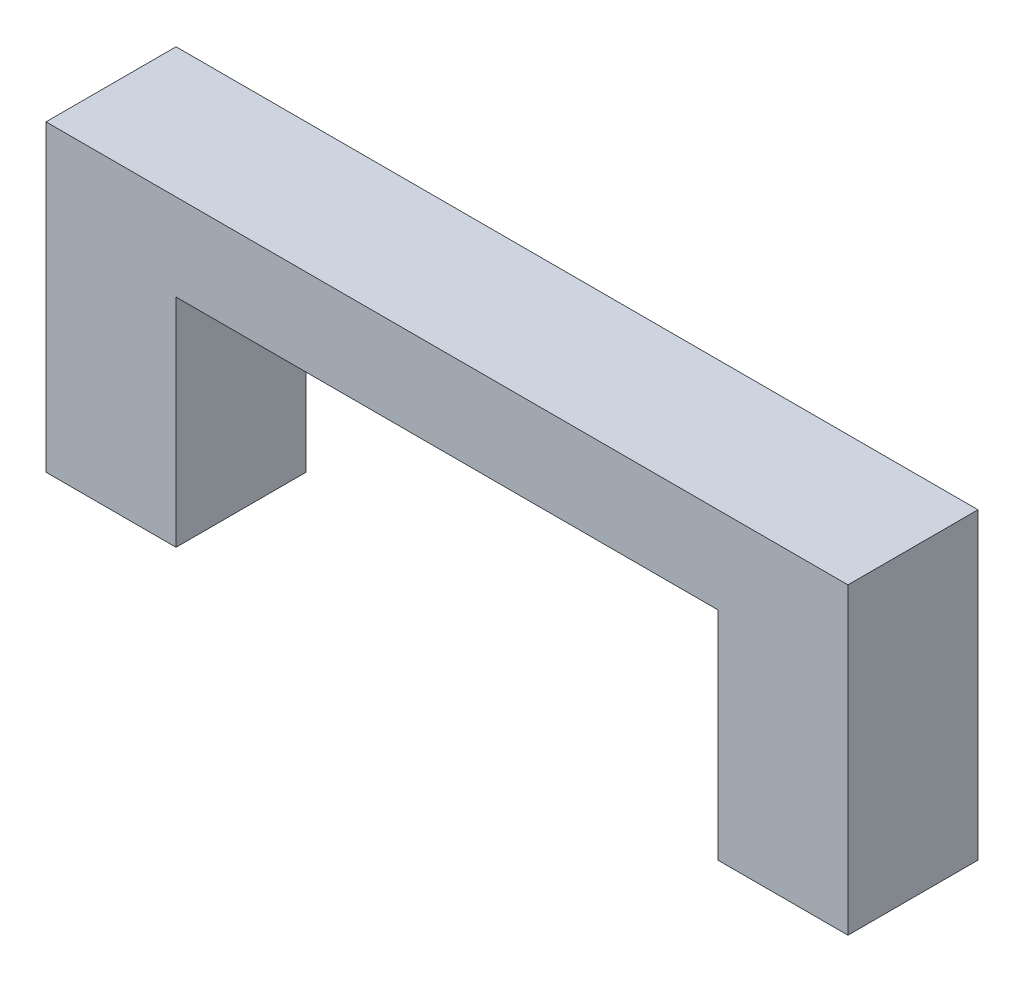
ISO-10303-21;
HEADER;
FILE_DESCRIPTION(('STEP AP214'),'2;1');
FILE_NAME('part.step','',(''),(''),'','','');
FILE_SCHEMA(('AUTOMOTIVE_DESIGN { 1 0 10303 214 1 1 1 1 }'));
ENDSEC;
DATA;
#1=APPLICATION_CONTEXT('core data for automotive mechanical design processes');
#2=APPLICATION_PROTOCOL_DEFINITION('international standard','automotive_design',2000,#1);
#3=PRODUCT_CONTEXT('',#1,'mechanical');
#4=PRODUCT('Part','Part','',(#3));
#5=PRODUCT_RELATED_PRODUCT_CATEGORY('part','',(#4));
#6=PRODUCT_DEFINITION_FORMATION('','',#4);
#7=PRODUCT_DEFINITION_CONTEXT('part definition',#1,'design');
#8=PRODUCT_DEFINITION('design','',#6,#7);
#9=PRODUCT_DEFINITION_SHAPE('','',#8);
#10=(LENGTH_UNIT() NAMED_UNIT(*) SI_UNIT(.MILLI.,.METRE.));
#11=(NAMED_UNIT(*) PLANE_ANGLE_UNIT() SI_UNIT($,.RADIAN.));
#12=(NAMED_UNIT(*) SI_UNIT($,.STERADIAN.) SOLID_ANGLE_UNIT());
#13=UNCERTAINTY_MEASURE_WITH_UNIT(LENGTH_MEASURE(1.E-05),#10,'distance_accuracy_value','');
#14=(GEOMETRIC_REPRESENTATION_CONTEXT(3) GLOBAL_UNCERTAINTY_ASSIGNED_CONTEXT((#13)) GLOBAL_UNIT_ASSIGNED_CONTEXT((#10,
#11,#12)) REPRESENTATION_CONTEXT('',''));
#15=CARTESIAN_POINT('',(0.,0.,0.));
#16=DIRECTION('',(0.,0.,1.));
#17=DIRECTION('',(1.,0.,0.));
#18=AXIS2_PLACEMENT_3D('',#15,#16,#17);
#19=CARTESIAN_POINT('',(18.5,0.,3.));
#20=DIRECTION('',(0.,1.,0.));
#21=DIRECTION('',(-1.,0.,0.));
#22=AXIS2_PLACEMENT_3D('',#19,#20,#21);
#23=PLANE('',#22);
#24=DIRECTION('',(1.,0.,0.));
#25=VECTOR('',#24,1.);
#26=CARTESIAN_POINT('',(18.5,0.,0.));
#27=LINE('',#26,#25);
#28=CARTESIAN_POINT('',(15.5,0.,0.));
#29=VERTEX_POINT('',#28);
#30=CARTESIAN_POINT('',(18.5,0.,0.));
#31=VERTEX_POINT('',#30);
#32=EDGE_CURVE('E237',#29,#31,#27,.T.);
#33=ORIENTED_EDGE('',*,*,#32,.T.);
#34=DIRECTION('',(0.,0.,-1.));
#35=VECTOR('',#34,1.);
#36=CARTESIAN_POINT('',(18.5,0.,3.));
#37=LINE('',#36,#35);
#38=CARTESIAN_POINT('',(18.5,0.,3.));
#39=VERTEX_POINT('',#38);
#40=EDGE_CURVE('E252',#39,#31,#37,.T.);
#41=ORIENTED_EDGE('',*,*,#40,.F.);
#42=DIRECTION('',(1.,0.,0.));
#43=VECTOR('',#42,1.);
#44=CARTESIAN_POINT('',(18.5,0.,3.));
#45=LINE('',#44,#43);
#46=CARTESIAN_POINT('',(15.5,0.,3.));
#47=VERTEX_POINT('',#46);
#48=EDGE_CURVE('E220',#47,#39,#45,.T.);
#49=ORIENTED_EDGE('',*,*,#48,.F.);
#50=DIRECTION('',(0.,0.,-1.));
#51=VECTOR('',#50,1.);
#52=CARTESIAN_POINT('',(15.5,0.,3.));
#53=LINE('',#52,#51);
#54=EDGE_CURVE('E255',#47,#29,#53,.T.);
#55=ORIENTED_EDGE('',*,*,#54,.T.);
#56=EDGE_LOOP('',(#33,#41,#49,#55));
#57=FACE_BOUND('',#56,.T.);
#58=DIRECTION('',(0.,0.,-1.));
#59=VECTOR('',#58,1.);
#60=CARTESIAN_POINT('',(17.75,0.,0.));
#61=LINE('',#60,#59);
#62=CARTESIAN_POINT('',(17.75,0.,2.25));
#63=VERTEX_POINT('',#62);
#64=CARTESIAN_POINT('',(17.75,0.,0.75));
#65=VERTEX_POINT('',#64);
#66=EDGE_CURVE('E57',#63,#65,#61,.T.);
#67=ORIENTED_EDGE('',*,*,#66,.T.);
#68=DIRECTION('',(1.,0.,0.));
#69=VECTOR('',#68,1.);
#70=CARTESIAN_POINT('',(0.,0.,0.75));
#71=LINE('',#70,#69);
#72=CARTESIAN_POINT('',(16.25,0.,0.75));
#73=VERTEX_POINT('',#72);
#74=EDGE_CURVE('E186',#73,#65,#71,.T.);
#75=ORIENTED_EDGE('',*,*,#74,.F.);
#76=DIRECTION('',(0.,0.,-1.));
#77=VECTOR('',#76,1.);
#78=CARTESIAN_POINT('',(16.25,0.,0.));
#79=LINE('',#78,#77);
#80=CARTESIAN_POINT('',(16.25,0.,2.25));
#81=VERTEX_POINT('',#80);
#82=EDGE_CURVE('E197',#81,#73,#79,.T.);
#83=ORIENTED_EDGE('',*,*,#82,.F.);
#84=DIRECTION('',(1.,0.,0.));
#85=VECTOR('',#84,1.);
#86=CARTESIAN_POINT('',(0.,0.,2.25));
#87=LINE('',#86,#85);
#88=EDGE_CURVE('E169',#81,#63,#87,.T.);
#89=ORIENTED_EDGE('',*,*,#88,.T.);
#90=EDGE_LOOP('',(#67,#75,#83,#89));
#91=FACE_BOUND('',#90,.T.);
#92=ADVANCED_FACE('F34',(#57,#91),#23,.F.);
#93=CARTESIAN_POINT('',(3.,0.,3.));
#94=DIRECTION('',(0.,1.,0.));
#95=DIRECTION('',(0.,0.,1.));
#96=AXIS2_PLACEMENT_3D('',#93,#94,#95);
#97=PLANE('',#96);
#98=DIRECTION('',(1.,0.,0.));
#99=VECTOR('',#98,1.);
#100=CARTESIAN_POINT('',(0.75,0.,0.75));
#101=LINE('',#100,#99);
#102=CARTESIAN_POINT('',(0.750000000000001,0.,0.75));
#103=VERTEX_POINT('',#102);
#104=CARTESIAN_POINT('',(2.25,0.,0.75));
#105=VERTEX_POINT('',#104);
#106=EDGE_CURVE('E167',#103,#105,#101,.T.);
#107=ORIENTED_EDGE('',*,*,#106,.F.);
#108=DIRECTION('',(0.,0.,-1.));
#109=VECTOR('',#108,1.);
#110=CARTESIAN_POINT('',(0.75,0.,2.25));
#111=LINE('',#110,#109);
#112=CARTESIAN_POINT('',(0.75,0.,2.25));
#113=VERTEX_POINT('',#112);
#114=EDGE_CURVE('E49',#113,#103,#111,.T.);
#115=ORIENTED_EDGE('',*,*,#114,.F.);
#116=DIRECTION('',(1.,0.,0.));
#117=VECTOR('',#116,1.);
#118=CARTESIAN_POINT('',(0.75,0.,2.25));
#119=LINE('',#118,#117);
#120=CARTESIAN_POINT('',(2.25,0.,2.25));
#121=VERTEX_POINT('',#120);
#122=EDGE_CURVE('E156',#113,#121,#119,.T.);
#123=ORIENTED_EDGE('',*,*,#122,.T.);
#124=DIRECTION('',(0.,0.,-1.));
#125=VECTOR('',#124,1.);
#126=CARTESIAN_POINT('',(2.25,0.,2.25));
#127=LINE('',#126,#125);
#128=EDGE_CURVE('E162',#121,#105,#127,.T.);
#129=ORIENTED_EDGE('',*,*,#128,.T.);
#130=EDGE_LOOP('',(#107,#115,#123,#129));
#131=FACE_BOUND('',#130,.T.);
#132=DIRECTION('',(1.,0.,0.));
#133=VECTOR('',#132,1.);
#134=CARTESIAN_POINT('',(3.,0.,0.));
#135=LINE('',#134,#133);
#136=CARTESIAN_POINT('',(0.,0.,0.));
#137=VERTEX_POINT('',#136);
#138=CARTESIAN_POINT('',(3.,0.,0.));
#139=VERTEX_POINT('',#138);
#140=EDGE_CURVE('E204',#137,#139,#135,.T.);
#141=ORIENTED_EDGE('',*,*,#140,.T.);
#142=DIRECTION('',(0.,0.,-1.));
#143=VECTOR('',#142,1.);
#144=CARTESIAN_POINT('',(3.,0.,3.));
#145=LINE('',#144,#143);
#146=CARTESIAN_POINT('',(3.,0.,3.));
#147=VERTEX_POINT('',#146);
#148=EDGE_CURVE('E11',#147,#139,#145,.T.);
#149=ORIENTED_EDGE('',*,*,#148,.F.);
#150=DIRECTION('',(1.,0.,0.));
#151=VECTOR('',#150,1.);
#152=CARTESIAN_POINT('',(3.,0.,3.));
#153=LINE('',#152,#151);
#154=CARTESIAN_POINT('',(0.,0.,3.));
#155=VERTEX_POINT('',#154);
#156=EDGE_CURVE('E210',#155,#147,#153,.T.);
#157=ORIENTED_EDGE('',*,*,#156,.F.);
#158=DIRECTION('',(0.,0.,-1.));
#159=VECTOR('',#158,1.);
#160=CARTESIAN_POINT('',(0.,0.,3.));
#161=LINE('',#160,#159);
#162=EDGE_CURVE('E228',#155,#137,#161,.T.);
#163=ORIENTED_EDGE('',*,*,#162,.T.);
#164=EDGE_LOOP('',(#141,#149,#157,#163));
#165=FACE_BOUND('',#164,.T.);
#166=ADVANCED_FACE('F36',(#131,#165),#97,.F.);
#167=CARTESIAN_POINT('',(3.,5.,3.));
#168=DIRECTION('',(-1.,0.,0.));
#169=DIRECTION('',(0.,0.,1.));
#170=AXIS2_PLACEMENT_3D('',#167,#168,#169);
#171=PLANE('',#170);
#172=DIRECTION('',(0.,1.,0.));
#173=VECTOR('',#172,1.);
#174=CARTESIAN_POINT('',(3.,5.,0.));
#175=LINE('',#174,#173);
#176=CARTESIAN_POINT('',(3.,5.,0.));
#177=VERTEX_POINT('',#176);
#178=EDGE_CURVE('E231',#139,#177,#175,.T.);
#179=ORIENTED_EDGE('',*,*,#178,.T.);
#180=DIRECTION('',(0.,0.,-1.));
#181=VECTOR('',#180,1.);
#182=CARTESIAN_POINT('',(3.,5.,3.));
#183=LINE('',#182,#181);
#184=CARTESIAN_POINT('',(3.,5.,3.));
#185=VERTEX_POINT('',#184);
#186=EDGE_CURVE('E42',#185,#177,#183,.T.);
#187=ORIENTED_EDGE('',*,*,#186,.F.);
#188=DIRECTION('',(0.,1.,0.));
#189=VECTOR('',#188,1.);
#190=CARTESIAN_POINT('',(3.,5.,3.));
#191=LINE('',#190,#189);
#192=EDGE_CURVE('E213',#147,#185,#191,.T.);
#193=ORIENTED_EDGE('',*,*,#192,.F.);
#194=ORIENTED_EDGE('',*,*,#148,.T.);
#195=EDGE_LOOP('',(#179,#187,#193,#194));
#196=FACE_BOUND('',#195,.T.);
#197=ADVANCED_FACE('F288',(#196),#171,.F.);
#198=CARTESIAN_POINT('',(15.5,5.,3.));
#199=DIRECTION('',(0.,1.,0.));
#200=DIRECTION('',(-1.,0.,0.));
#201=AXIS2_PLACEMENT_3D('',#198,#199,#200);
#202=PLANE('',#201);
#203=DIRECTION('',(1.,0.,0.));
#204=VECTOR('',#203,1.);
#205=CARTESIAN_POINT('',(15.5,5.,0.));
#206=LINE('',#205,#204);
#207=CARTESIAN_POINT('',(15.5,5.,0.));
#208=VERTEX_POINT('',#207);
#209=EDGE_CURVE('E233',#177,#208,#206,.T.);
#210=ORIENTED_EDGE('',*,*,#209,.T.);
#211=DIRECTION('',(0.,0.,-1.));
#212=VECTOR('',#211,1.);
#213=CARTESIAN_POINT('',(15.5,5.,3.));
#214=LINE('',#213,#212);
#215=CARTESIAN_POINT('',(15.5,5.,3.));
#216=VERTEX_POINT('',#215);
#217=EDGE_CURVE('E258',#216,#208,#214,.T.);
#218=ORIENTED_EDGE('',*,*,#217,.F.);
#219=DIRECTION('',(1.,0.,0.));
#220=VECTOR('',#219,1.);
#221=CARTESIAN_POINT('',(15.5,5.,3.));
#222=LINE('',#221,#220);
#223=EDGE_CURVE('E216',#185,#216,#222,.T.);
#224=ORIENTED_EDGE('',*,*,#223,.F.);
#225=ORIENTED_EDGE('',*,*,#186,.T.);
#226=EDGE_LOOP('',(#210,#218,#224,#225));
#227=FACE_BOUND('',#226,.T.);
#228=ADVANCED_FACE('F265',(#227),#202,.F.);
#229=CARTESIAN_POINT('',(15.5,0.,3.));
#230=DIRECTION('',(1.,0.,0.));
#231=DIRECTION('',(0.,0.,-1.));
#232=AXIS2_PLACEMENT_3D('',#229,#230,#231);
#233=PLANE('',#232);
#234=DIRECTION('',(0.,-1.,0.));
#235=VECTOR('',#234,1.);
#236=CARTESIAN_POINT('',(15.5,0.,0.));
#237=LINE('',#236,#235);
#238=EDGE_CURVE('E235',#208,#29,#237,.T.);
#239=ORIENTED_EDGE('',*,*,#238,.T.);
#240=ORIENTED_EDGE('',*,*,#54,.F.);
#241=DIRECTION('',(0.,-1.,0.));
#242=VECTOR('',#241,1.);
#243=CARTESIAN_POINT('',(15.5,0.,3.));
#244=LINE('',#243,#242);
#245=EDGE_CURVE('E218',#216,#47,#244,.T.);
#246=ORIENTED_EDGE('',*,*,#245,.F.);
#247=ORIENTED_EDGE('',*,*,#217,.T.);
#248=EDGE_LOOP('',(#239,#240,#246,#247));
#249=FACE_BOUND('',#248,.T.);
#250=ADVANCED_FACE('F276',(#249),#233,.F.);
#251=CARTESIAN_POINT('',(18.5,7.,3.));
#252=DIRECTION('',(-1.,0.,0.));
#253=DIRECTION('',(0.,0.,1.));
#254=AXIS2_PLACEMENT_3D('',#251,#252,#253);
#255=PLANE('',#254);
#256=DIRECTION('',(0.,1.,0.));
#257=VECTOR('',#256,1.);
#258=CARTESIAN_POINT('',(18.5,7.,0.));
#259=LINE('',#258,#257);
#260=CARTESIAN_POINT('',(18.5,7.,0.));
#261=VERTEX_POINT('',#260);
#262=EDGE_CURVE('E239',#31,#261,#259,.T.);
#263=ORIENTED_EDGE('',*,*,#262,.T.);
#264=DIRECTION('',(0.,0.,-1.));
#265=VECTOR('',#264,1.);
#266=CARTESIAN_POINT('',(18.5,7.,3.));
#267=LINE('',#266,#265);
#268=CARTESIAN_POINT('',(18.5,7.,3.));
#269=VERTEX_POINT('',#268);
#270=EDGE_CURVE('E249',#269,#261,#267,.T.);
#271=ORIENTED_EDGE('',*,*,#270,.F.);
#272=DIRECTION('',(0.,1.,0.));
#273=VECTOR('',#272,1.);
#274=CARTESIAN_POINT('',(18.5,7.,3.));
#275=LINE('',#274,#273);
#276=EDGE_CURVE('E222',#39,#269,#275,.T.);
#277=ORIENTED_EDGE('',*,*,#276,.F.);
#278=ORIENTED_EDGE('',*,*,#40,.T.);
#279=EDGE_LOOP('',(#263,#271,#277,#278));
#280=FACE_BOUND('',#279,.T.);
#281=ADVANCED_FACE('F300',(#280),#255,.F.);
#282=CARTESIAN_POINT('',(0.,7.,3.));
#283=DIRECTION('',(0.,-1.,0.));
#284=DIRECTION('',(0.,0.,-1.));
#285=AXIS2_PLACEMENT_3D('',#282,#283,#284);
#286=PLANE('',#285);
#287=DIRECTION('',(-1.,0.,0.));
#288=VECTOR('',#287,1.);
#289=CARTESIAN_POINT('',(0.,7.,0.));
#290=LINE('',#289,#288);
#291=CARTESIAN_POINT('',(0.,7.,0.));
#292=VERTEX_POINT('',#291);
#293=EDGE_CURVE('E241',#261,#292,#290,.T.);
#294=ORIENTED_EDGE('',*,*,#293,.T.);
#295=DIRECTION('',(0.,0.,-1.));
#296=VECTOR('',#295,1.);
#297=CARTESIAN_POINT('',(0.,7.,3.));
#298=LINE('',#297,#296);
#299=CARTESIAN_POINT('',(0.,7.,3.));
#300=VERTEX_POINT('',#299);
#301=EDGE_CURVE('E246',#300,#292,#298,.T.);
#302=ORIENTED_EDGE('',*,*,#301,.F.);
#303=DIRECTION('',(-1.,0.,0.));
#304=VECTOR('',#303,1.);
#305=CARTESIAN_POINT('',(0.,7.,3.));
#306=LINE('',#305,#304);
#307=EDGE_CURVE('E224',#269,#300,#306,.T.);
#308=ORIENTED_EDGE('',*,*,#307,.F.);
#309=ORIENTED_EDGE('',*,*,#270,.T.);
#310=EDGE_LOOP('',(#294,#302,#308,#309));
#311=FACE_BOUND('',#310,.T.);
#312=ADVANCED_FACE('F298',(#311),#286,.F.);
#313=CARTESIAN_POINT('',(0.,0.,3.));
#314=DIRECTION('',(1.,0.,0.));
#315=DIRECTION('',(0.,0.,-1.));
#316=AXIS2_PLACEMENT_3D('',#313,#314,#315);
#317=PLANE('',#316);
#318=DIRECTION('',(0.,-1.,0.));
#319=VECTOR('',#318,1.);
#320=CARTESIAN_POINT('',(0.,0.,0.));
#321=LINE('',#320,#319);
#322=EDGE_CURVE('E214',#292,#137,#321,.T.);
#323=ORIENTED_EDGE('',*,*,#322,.T.);
#324=ORIENTED_EDGE('',*,*,#162,.F.);
#325=DIRECTION('',(0.,-1.,0.));
#326=VECTOR('',#325,1.);
#327=CARTESIAN_POINT('',(0.,0.,3.));
#328=LINE('',#327,#326);
#329=EDGE_CURVE('E226',#300,#155,#328,.T.);
#330=ORIENTED_EDGE('',*,*,#329,.F.);
#331=ORIENTED_EDGE('',*,*,#301,.T.);
#332=EDGE_LOOP('',(#323,#324,#330,#331));
#333=FACE_BOUND('',#332,.T.);
#334=ADVANCED_FACE('F293',(#333),#317,.F.);
#335=CARTESIAN_POINT('',(0.,0.,3.));
#336=DIRECTION('',(0.,0.,-1.));
#337=DIRECTION('',(-1.,0.,0.));
#338=AXIS2_PLACEMENT_3D('',#335,#336,#337);
#339=PLANE('',#338);
#340=ORIENTED_EDGE('',*,*,#156,.T.);
#341=ORIENTED_EDGE('',*,*,#192,.T.);
#342=ORIENTED_EDGE('',*,*,#223,.T.);
#343=ORIENTED_EDGE('',*,*,#245,.T.);
#344=ORIENTED_EDGE('',*,*,#48,.T.);
#345=ORIENTED_EDGE('',*,*,#276,.T.);
#346=ORIENTED_EDGE('',*,*,#307,.T.);
#347=ORIENTED_EDGE('',*,*,#329,.T.);
#348=EDGE_LOOP('',(#340,#341,#342,#343,#344,#345,#346,#347));
#349=FACE_BOUND('',#348,.T.);
#350=ADVANCED_FACE('F284',(#349),#339,.F.);
#351=CARTESIAN_POINT('',(0.,0.,0.));
#352=DIRECTION('',(0.,0.,-1.));
#353=DIRECTION('',(-1.,0.,0.));
#354=AXIS2_PLACEMENT_3D('',#351,#352,#353);
#355=PLANE('',#354);
#356=ORIENTED_EDGE('',*,*,#140,.F.);
#357=ORIENTED_EDGE('',*,*,#322,.F.);
#358=ORIENTED_EDGE('',*,*,#293,.F.);
#359=ORIENTED_EDGE('',*,*,#262,.F.);
#360=ORIENTED_EDGE('',*,*,#32,.F.);
#361=ORIENTED_EDGE('',*,*,#238,.F.);
#362=ORIENTED_EDGE('',*,*,#209,.F.);
#363=ORIENTED_EDGE('',*,*,#178,.F.);
#364=EDGE_LOOP('',(#356,#357,#358,#359,#360,#361,#362,#363));
#365=FACE_BOUND('',#364,.T.);
#366=ADVANCED_FACE('F271',(#365),#355,.T.);
#367=CARTESIAN_POINT('',(17.75,2.2,0.));
#368=DIRECTION('',(-1.,0.,0.));
#369=DIRECTION('',(0.,0.,1.));
#370=AXIS2_PLACEMENT_3D('',#367,#368,#369);
#371=PLANE('',#370);
#372=ORIENTED_EDGE('',*,*,#66,.F.);
#373=DIRECTION('',(0.,-1.,0.));
#374=VECTOR('',#373,1.);
#375=CARTESIAN_POINT('',(17.75,2.2,2.25));
#376=LINE('',#375,#374);
#377=CARTESIAN_POINT('',(17.75,2.2,2.25));
#378=VERTEX_POINT('',#377);
#379=EDGE_CURVE('E193',#378,#63,#376,.T.);
#380=ORIENTED_EDGE('',*,*,#379,.F.);
#381=DIRECTION('',(0.,0.,-1.));
#382=VECTOR('',#381,1.);
#383=CARTESIAN_POINT('',(17.75,2.2,0.));
#384=LINE('',#383,#382);
#385=CARTESIAN_POINT('',(17.75,2.2,0.75));
#386=VERTEX_POINT('',#385);
#387=EDGE_CURVE('E183',#378,#386,#384,.T.);
#388=ORIENTED_EDGE('',*,*,#387,.T.);
#389=DIRECTION('',(0.,-1.,0.));
#390=VECTOR('',#389,1.);
#391=CARTESIAN_POINT('',(17.75,2.2,0.75));
#392=LINE('',#391,#390);
#393=EDGE_CURVE('E202',#386,#65,#392,.T.);
#394=ORIENTED_EDGE('',*,*,#393,.T.);
#395=EDGE_LOOP('',(#372,#380,#388,#394));
#396=FACE_BOUND('',#395,.T.);
#397=ADVANCED_FACE('F363',(#396),#371,.T.);
#398=CARTESIAN_POINT('',(0.,2.2,0.75));
#399=DIRECTION('',(0.,0.,-1.));
#400=DIRECTION('',(-1.,0.,0.));
#401=AXIS2_PLACEMENT_3D('',#398,#399,#400);
#402=PLANE('',#401);
#403=ORIENTED_EDGE('',*,*,#74,.T.);
#404=ORIENTED_EDGE('',*,*,#393,.F.);
#405=DIRECTION('',(1.,0.,0.));
#406=VECTOR('',#405,1.);
#407=CARTESIAN_POINT('',(0.,2.2,0.75));
#408=LINE('',#407,#406);
#409=CARTESIAN_POINT('',(16.25,2.2,0.75));
#410=VERTEX_POINT('',#409);
#411=EDGE_CURVE('E191',#410,#386,#408,.T.);
#412=ORIENTED_EDGE('',*,*,#411,.F.);
#413=DIRECTION('',(0.,-1.,0.));
#414=VECTOR('',#413,1.);
#415=CARTESIAN_POINT('',(16.25,2.2,0.75));
#416=LINE('',#415,#414);
#417=EDGE_CURVE('E205',#410,#73,#416,.T.);
#418=ORIENTED_EDGE('',*,*,#417,.T.);
#419=EDGE_LOOP('',(#403,#404,#412,#418));
#420=FACE_BOUND('',#419,.T.);
#421=ADVANCED_FACE('F381',(#420),#402,.F.);
#422=CARTESIAN_POINT('',(16.25,2.2,0.));
#423=DIRECTION('',(-1.,0.,0.));
#424=DIRECTION('',(0.,0.,1.));
#425=AXIS2_PLACEMENT_3D('',#422,#423,#424);
#426=PLANE('',#425);
#427=ORIENTED_EDGE('',*,*,#82,.T.);
#428=ORIENTED_EDGE('',*,*,#417,.F.);
#429=DIRECTION('',(0.,0.,-1.));
#430=VECTOR('',#429,1.);
#431=CARTESIAN_POINT('',(16.25,2.2,0.));
#432=LINE('',#431,#430);
#433=CARTESIAN_POINT('',(16.25,2.2,2.25));
#434=VERTEX_POINT('',#433);
#435=EDGE_CURVE('E188',#434,#410,#432,.T.);
#436=ORIENTED_EDGE('',*,*,#435,.F.);
#437=DIRECTION('',(0.,-1.,0.));
#438=VECTOR('',#437,1.);
#439=CARTESIAN_POINT('',(16.25,2.2,2.25));
#440=LINE('',#439,#438);
#441=EDGE_CURVE('E207',#434,#81,#440,.T.);
#442=ORIENTED_EDGE('',*,*,#441,.T.);
#443=EDGE_LOOP('',(#427,#428,#436,#442));
#444=FACE_BOUND('',#443,.T.);
#445=ADVANCED_FACE('F390',(#444),#426,.F.);
#446=CARTESIAN_POINT('',(0.,2.2,2.25));
#447=DIRECTION('',(0.,0.,-1.));
#448=DIRECTION('',(-1.,0.,0.));
#449=AXIS2_PLACEMENT_3D('',#446,#447,#448);
#450=PLANE('',#449);
#451=ORIENTED_EDGE('',*,*,#88,.F.);
#452=ORIENTED_EDGE('',*,*,#441,.F.);
#453=DIRECTION('',(1.,0.,0.));
#454=VECTOR('',#453,1.);
#455=CARTESIAN_POINT('',(0.,2.2,2.25));
#456=LINE('',#455,#454);
#457=EDGE_CURVE('E185',#434,#378,#456,.T.);
#458=ORIENTED_EDGE('',*,*,#457,.T.);
#459=ORIENTED_EDGE('',*,*,#379,.T.);
#460=EDGE_LOOP('',(#451,#452,#458,#459));
#461=FACE_BOUND('',#460,.T.);
#462=ADVANCED_FACE('F400',(#461),#450,.T.);
#463=CARTESIAN_POINT('',(0.,2.2,0.));
#464=DIRECTION('',(0.,-1.,0.));
#465=DIRECTION('',(0.,0.,-1.));
#466=AXIS2_PLACEMENT_3D('',#463,#464,#465);
#467=PLANE('',#466);
#468=ORIENTED_EDGE('',*,*,#387,.F.);
#469=ORIENTED_EDGE('',*,*,#457,.F.);
#470=ORIENTED_EDGE('',*,*,#435,.T.);
#471=ORIENTED_EDGE('',*,*,#411,.T.);
#472=EDGE_LOOP('',(#468,#469,#470,#471));
#473=FACE_BOUND('',#472,.T.);
#474=ADVANCED_FACE('F410',(#473),#467,.T.);
#475=CARTESIAN_POINT('',(0.75,2.2,2.25));
#476=DIRECTION('',(-1.,0.,0.));
#477=DIRECTION('',(0.,0.,1.));
#478=AXIS2_PLACEMENT_3D('',#475,#476,#477);
#479=PLANE('',#478);
#480=ORIENTED_EDGE('',*,*,#114,.T.);
#481=DIRECTION('',(0.,-1.,0.));
#482=VECTOR('',#481,1.);
#483=CARTESIAN_POINT('',(0.75,2.2,0.75));
#484=LINE('',#483,#482);
#485=CARTESIAN_POINT('',(0.75,2.2,0.75));
#486=VERTEX_POINT('',#485);
#487=EDGE_CURVE('E177',#486,#103,#484,.T.);
#488=ORIENTED_EDGE('',*,*,#487,.F.);
#489=DIRECTION('',(0.,0.,-1.));
#490=VECTOR('',#489,1.);
#491=CARTESIAN_POINT('',(0.75,2.2,2.25));
#492=LINE('',#491,#490);
#493=CARTESIAN_POINT('',(0.75,2.2,2.25));
#494=VERTEX_POINT('',#493);
#495=EDGE_CURVE('E150',#494,#486,#492,.T.);
#496=ORIENTED_EDGE('',*,*,#495,.F.);
#497=DIRECTION('',(0.,-1.,0.));
#498=VECTOR('',#497,1.);
#499=CARTESIAN_POINT('',(0.75,2.2,2.25));
#500=LINE('',#499,#498);
#501=EDGE_CURVE('E146',#494,#113,#500,.T.);
#502=ORIENTED_EDGE('',*,*,#501,.T.);
#503=EDGE_LOOP('',(#480,#488,#496,#502));
#504=FACE_BOUND('',#503,.T.);
#505=ADVANCED_FACE('F148',(#504),#479,.F.);
#506=CARTESIAN_POINT('',(0.75,2.2,2.25));
#507=DIRECTION('',(0.,0.,-1.));
#508=DIRECTION('',(-1.,0.,0.));
#509=AXIS2_PLACEMENT_3D('',#506,#507,#508);
#510=PLANE('',#509);
#511=ORIENTED_EDGE('',*,*,#122,.F.);
#512=ORIENTED_EDGE('',*,*,#501,.F.);
#513=DIRECTION('',(1.,0.,0.));
#514=VECTOR('',#513,1.);
#515=CARTESIAN_POINT('',(0.75,2.2,2.25));
#516=LINE('',#515,#514);
#517=CARTESIAN_POINT('',(2.25,2.2,2.25));
#518=VERTEX_POINT('',#517);
#519=EDGE_CURVE('E174',#494,#518,#516,.T.);
#520=ORIENTED_EDGE('',*,*,#519,.T.);
#521=DIRECTION('',(0.,-1.,0.));
#522=VECTOR('',#521,1.);
#523=CARTESIAN_POINT('',(2.25,2.2,2.25));
#524=LINE('',#523,#522);
#525=EDGE_CURVE('E153',#518,#121,#524,.T.);
#526=ORIENTED_EDGE('',*,*,#525,.T.);
#527=EDGE_LOOP('',(#511,#512,#520,#526));
#528=FACE_BOUND('',#527,.T.);
#529=ADVANCED_FACE('F157',(#528),#510,.T.);
#530=CARTESIAN_POINT('',(2.25,2.2,2.25));
#531=DIRECTION('',(-1.,0.,0.));
#532=DIRECTION('',(0.,0.,1.));
#533=AXIS2_PLACEMENT_3D('',#530,#531,#532);
#534=PLANE('',#533);
#535=ORIENTED_EDGE('',*,*,#128,.F.);
#536=ORIENTED_EDGE('',*,*,#525,.F.);
#537=DIRECTION('',(0.,0.,-1.));
#538=VECTOR('',#537,1.);
#539=CARTESIAN_POINT('',(2.25,2.2,2.25));
#540=LINE('',#539,#538);
#541=CARTESIAN_POINT('',(2.25,2.2,0.75));
#542=VERTEX_POINT('',#541);
#543=EDGE_CURVE('E176',#518,#542,#540,.T.);
#544=ORIENTED_EDGE('',*,*,#543,.T.);
#545=DIRECTION('',(0.,-1.,0.));
#546=VECTOR('',#545,1.);
#547=CARTESIAN_POINT('',(2.25,2.2,0.75));
#548=LINE('',#547,#546);
#549=EDGE_CURVE('E473',#542,#105,#548,.T.);
#550=ORIENTED_EDGE('',*,*,#549,.T.);
#551=EDGE_LOOP('',(#535,#536,#544,#550));
#552=FACE_BOUND('',#551,.T.);
#553=ADVANCED_FACE('F437',(#552),#534,.T.);
#554=CARTESIAN_POINT('',(0.75,2.2,0.75));
#555=DIRECTION('',(0.,0.,-1.));
#556=DIRECTION('',(-1.,0.,0.));
#557=AXIS2_PLACEMENT_3D('',#554,#555,#556);
#558=PLANE('',#557);
#559=ORIENTED_EDGE('',*,*,#106,.T.);
#560=ORIENTED_EDGE('',*,*,#549,.F.);
#561=DIRECTION('',(1.,0.,0.));
#562=VECTOR('',#561,1.);
#563=CARTESIAN_POINT('',(0.75,2.2,0.75));
#564=LINE('',#563,#562);
#565=EDGE_CURVE('E179',#486,#542,#564,.T.);
#566=ORIENTED_EDGE('',*,*,#565,.F.);
#567=ORIENTED_EDGE('',*,*,#487,.T.);
#568=EDGE_LOOP('',(#559,#560,#566,#567));
#569=FACE_BOUND('',#568,.T.);
#570=ADVANCED_FACE('F446',(#569),#558,.F.);
#571=CARTESIAN_POINT('',(0.,2.2,0.));
#572=DIRECTION('',(0.,-1.,0.));
#573=DIRECTION('',(0.,0.,-1.));
#574=AXIS2_PLACEMENT_3D('',#571,#572,#573);
#575=PLANE('',#574);
#576=ORIENTED_EDGE('',*,*,#495,.T.);
#577=ORIENTED_EDGE('',*,*,#565,.T.);
#578=ORIENTED_EDGE('',*,*,#543,.F.);
#579=ORIENTED_EDGE('',*,*,#519,.F.);
#580=EDGE_LOOP('',(#576,#577,#578,#579));
#581=FACE_BOUND('',#580,.T.);
#582=ADVANCED_FACE('F456',(#581),#575,.T.);
#583=CLOSED_SHELL('',(#92,#166,#197,#228,#250,#281,#312,#334,#350,#366,#397,#421,#445,#462,#474,
#505,#529,#553,#570,#582));
#584=MANIFOLD_SOLID_BREP('B2',#583);
#585=ADVANCED_BREP_SHAPE_REPRESENTATION('',(#18,#584),#14);
#586=SHAPE_DEFINITION_REPRESENTATION(#9,#585);
ENDSEC;
END-ISO-10303-21;
